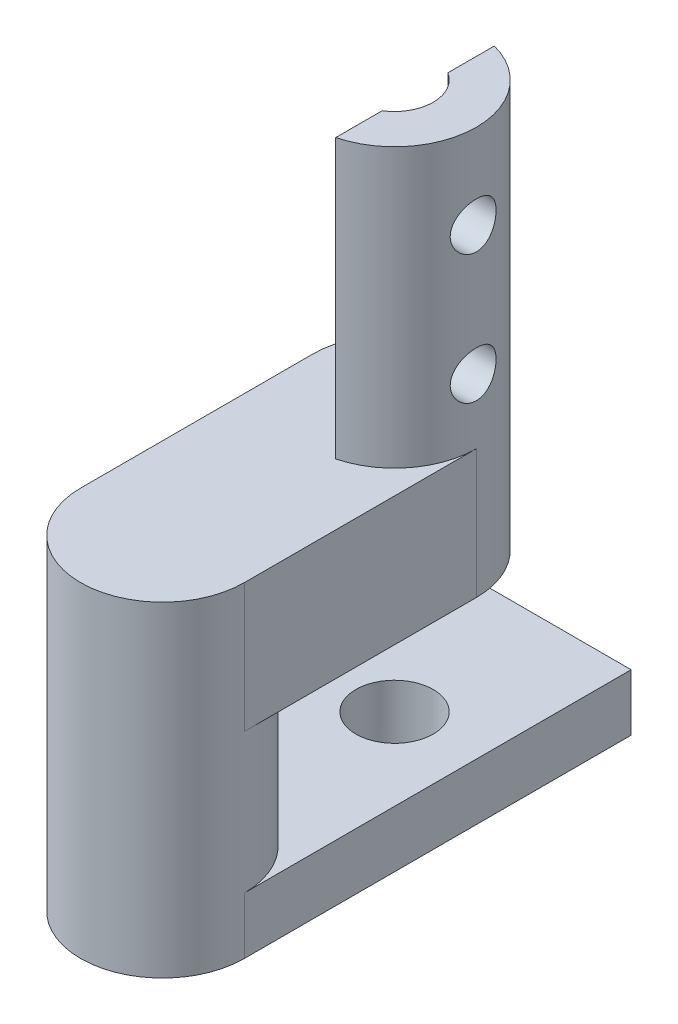
ISO-10303-21;
HEADER;
FILE_DESCRIPTION(('STEP AP214'),'2;1');
FILE_NAME('part.step','',(''),(''),'','','');
FILE_SCHEMA(('AUTOMOTIVE_DESIGN { 1 0 10303 214 1 1 1 1 }'));
ENDSEC;
DATA;
#1=APPLICATION_CONTEXT('core data for automotive mechanical design processes');
#2=APPLICATION_PROTOCOL_DEFINITION('international standard','automotive_design',2000,#1);
#3=PRODUCT_CONTEXT('',#1,'mechanical');
#4=PRODUCT('Part','Part','',(#3));
#5=PRODUCT_RELATED_PRODUCT_CATEGORY('part','',(#4));
#6=PRODUCT_DEFINITION_FORMATION('','',#4);
#7=PRODUCT_DEFINITION_CONTEXT('part definition',#1,'design');
#8=PRODUCT_DEFINITION('design','',#6,#7);
#9=PRODUCT_DEFINITION_SHAPE('','',#8);
#10=(LENGTH_UNIT() NAMED_UNIT(*) SI_UNIT(.MILLI.,.METRE.));
#11=(NAMED_UNIT(*) PLANE_ANGLE_UNIT() SI_UNIT($,.RADIAN.));
#12=(NAMED_UNIT(*) SI_UNIT($,.STERADIAN.) SOLID_ANGLE_UNIT());
#13=UNCERTAINTY_MEASURE_WITH_UNIT(LENGTH_MEASURE(1.E-05),#10,'distance_accuracy_value','');
#14=(GEOMETRIC_REPRESENTATION_CONTEXT(3) GLOBAL_UNCERTAINTY_ASSIGNED_CONTEXT((#13)) GLOBAL_UNIT_ASSIGNED_CONTEXT((#10,
#11,#12)) REPRESENTATION_CONTEXT('',''));
#15=CARTESIAN_POINT('',(0.,0.,0.));
#16=DIRECTION('',(0.,0.,1.));
#17=DIRECTION('',(1.,0.,0.));
#18=AXIS2_PLACEMENT_3D('',#15,#16,#17);
#19=CARTESIAN_POINT('',(0.,57.15,0.));
#20=DIRECTION('',(0.,-1.,0.));
#21=DIRECTION('',(0.,0.,-1.));
#22=AXIS2_PLACEMENT_3D('',#19,#20,#21);
#23=CYLINDRICAL_SURFACE('',#22,3.175);
#24=DIRECTION('',(0.,1.,0.));
#25=VECTOR('',#24,1.);
#26=CARTESIAN_POINT('',(3.175,33.73,0.));
#27=LINE('',#26,#25);
#28=CARTESIAN_POINT('',(3.175,33.73,0.));
#29=VERTEX_POINT('',#28);
#30=CARTESIAN_POINT('',(3.175,35.93,0.));
#31=VERTEX_POINT('',#30);
#32=EDGE_CURVE('E226',#29,#31,#27,.T.);
#33=ORIENTED_EDGE('',*,*,#32,.T.);
#34=CARTESIAN_POINT('',(0.,35.93,0.));
#35=DIRECTION('',(0.,-1.,0.));
#36=DIRECTION('',(0.,0.,-1.));
#37=AXIS2_PLACEMENT_3D('',#34,#35,#36);
#38=CIRCLE('',#37,3.175);
#39=CARTESIAN_POINT('',(-3.175,35.93,0.));
#40=VERTEX_POINT('',#39);
#41=EDGE_CURVE('E132',#40,#31,#38,.T.);
#42=ORIENTED_EDGE('',*,*,#41,.F.);
#43=DIRECTION('',(0.,1.,0.));
#44=VECTOR('',#43,1.);
#45=CARTESIAN_POINT('',(-3.175,33.73,0.));
#46=LINE('',#45,#44);
#47=CARTESIAN_POINT('',(-3.175,33.73,0.));
#48=VERTEX_POINT('',#47);
#49=EDGE_CURVE('E133',#48,#40,#46,.T.);
#50=ORIENTED_EDGE('',*,*,#49,.F.);
#51=CARTESIAN_POINT('',(0.,33.73,0.));
#52=DIRECTION('',(0.,-1.,0.));
#53=DIRECTION('',(0.,0.,-1.));
#54=AXIS2_PLACEMENT_3D('',#51,#52,#53);
#55=CIRCLE('',#54,3.175);
#56=EDGE_CURVE('E231',#29,#48,#55,.T.);
#57=ORIENTED_EDGE('',*,*,#56,.F.);
#58=EDGE_LOOP('',(#33,#42,#50,#57));
#59=FACE_BOUND('',#58,.T.);
#60=DIRECTION('',(0.,1.,0.));
#61=VECTOR('',#60,1.);
#62=CARTESIAN_POINT('',(3.175,41.355,0.));
#63=LINE('',#62,#61);
#64=CARTESIAN_POINT('',(3.175,41.355,0.));
#65=VERTEX_POINT('',#64);
#66=CARTESIAN_POINT('',(3.175,46.355,0.));
#67=VERTEX_POINT('',#66);
#68=EDGE_CURVE('E135',#65,#67,#63,.T.);
#69=ORIENTED_EDGE('',*,*,#68,.T.);
#70=CARTESIAN_POINT('',(0.,46.355,0.));
#71=DIRECTION('',(0.,-1.,0.));
#72=DIRECTION('',(0.,0.,-1.));
#73=AXIS2_PLACEMENT_3D('',#70,#71,#72);
#74=CIRCLE('',#73,3.175);
#75=CARTESIAN_POINT('',(-3.175,46.355,0.));
#76=VERTEX_POINT('',#75);
#77=EDGE_CURVE('E125',#67,#76,#74,.T.);
#78=ORIENTED_EDGE('',*,*,#77,.T.);
#79=DIRECTION('',(0.,1.,0.));
#80=VECTOR('',#79,1.);
#81=CARTESIAN_POINT('',(-3.175,41.355,0.));
#82=LINE('',#81,#80);
#83=CARTESIAN_POINT('',(-3.175,41.355,0.));
#84=VERTEX_POINT('',#83);
#85=EDGE_CURVE('E53',#84,#76,#82,.T.);
#86=ORIENTED_EDGE('',*,*,#85,.F.);
#87=CARTESIAN_POINT('',(0.,41.355,0.));
#88=DIRECTION('',(0.,-1.,0.));
#89=DIRECTION('',(0.,0.,1.));
#90=AXIS2_PLACEMENT_3D('',#87,#88,#89);
#91=CIRCLE('',#90,3.175);
#92=EDGE_CURVE('E57',#84,#65,#91,.T.);
#93=ORIENTED_EDGE('',*,*,#92,.T.);
#94=EDGE_LOOP('',(#69,#78,#86,#93));
#95=FACE_BOUND('',#94,.T.);
#96=ADVANCED_FACE('F37',(#59,#95),#23,.T.);
#97=CARTESIAN_POINT('',(0.,33.73,-9.));
#98=DIRECTION('',(0.,1.,0.));
#99=DIRECTION('',(0.,0.,1.));
#100=AXIS2_PLACEMENT_3D('',#97,#98,#99);
#101=CYLINDRICAL_SURFACE('',#100,1.5);
#102=CARTESIAN_POINT('',(0.,33.73,-9.));
#103=DIRECTION('',(0.,-1.,0.));
#104=DIRECTION('',(0.,0.,-1.));
#105=AXIS2_PLACEMENT_3D('',#102,#103,#104);
#106=CIRCLE('',#105,1.5);
#107=CARTESIAN_POINT('',(0.,33.73,-10.5));
#108=VERTEX_POINT('',#107);
#109=EDGE_CURVE('E258',#108,#108,#106,.T.);
#110=ORIENTED_EDGE('',*,*,#109,.T.);
#111=EDGE_LOOP('',(#110));
#112=FACE_BOUND('',#111,.T.);
#113=CARTESIAN_POINT('',(0.,35.93,-9.));
#114=DIRECTION('',(0.,1.,0.));
#115=DIRECTION('',(0.,0.,1.));
#116=AXIS2_PLACEMENT_3D('',#113,#114,#115);
#117=CIRCLE('',#116,1.5);
#118=CARTESIAN_POINT('',(0.,35.93,-7.5));
#119=VERTEX_POINT('',#118);
#120=EDGE_CURVE('E40',#119,#119,#117,.T.);
#121=ORIENTED_EDGE('',*,*,#120,.T.);
#122=EDGE_LOOP('',(#121));
#123=FACE_BOUND('',#122,.T.);
#124=ADVANCED_FACE('F203',(#112,#123),#101,.F.);
#125=CARTESIAN_POINT('',(0.,57.15,-9.));
#126=DIRECTION('',(0.,-1.,0.));
#127=DIRECTION('',(0.,0.,-1.));
#128=AXIS2_PLACEMENT_3D('',#125,#126,#127);
#129=CYLINDRICAL_SURFACE('',#128,3.175);
#130=CARTESIAN_POINT('',(3.048,53.855,-8.111));
#131=CARTESIAN_POINT('',(3.04800074144579,53.9038733654637,-8.11100097729502));
#132=CARTESIAN_POINT('',(3.0491883536904,53.9527567364062,-8.11504399409992));
#133=CARTESIAN_POINT('',(3.05379446473852,54.0491049848988,-8.13107438578842));
#134=CARTESIAN_POINT('',(3.05721393512249,54.096569235257,-8.14306522057987));
#135=CARTESIAN_POINT('',(3.06586679255467,54.1886712317961,-8.17456073973509));
#136=CARTESIAN_POINT('',(3.07109744934927,54.2333131134177,-8.19405411937212));
#137=CARTESIAN_POINT('',(3.08277975485952,54.3187015211283,-8.23996524363441));
#138=CARTESIAN_POINT('',(3.0892315334209,54.3594476322734,-8.26638372474263));
#139=CARTESIAN_POINT('',(3.10282851808416,54.4370111447716,-8.32617435077648));
#140=CARTESIAN_POINT('',(3.10998700385331,54.4737052421074,-8.35970346666669));
#141=CARTESIAN_POINT('',(3.12407666925912,54.5410299343499,-8.43242645778973));
#142=CARTESIAN_POINT('',(3.13100782316884,54.5716598449399,-8.47162097147539));
#143=CARTESIAN_POINT('',(3.14401109305889,54.6265090608122,-8.55542576249639));
#144=CARTESIAN_POINT('',(3.15006572408435,54.6506045660182,-8.60012001481016));
#145=CARTESIAN_POINT('',(3.16048064645675,54.6908915244847,-8.69312365720012));
#146=CARTESIAN_POINT('',(3.16484125401579,54.7070844530113,-8.74143237057917));
#147=CARTESIAN_POINT('',(3.17128288506878,54.7307040631926,-8.83900538660209));
#148=CARTESIAN_POINT('',(3.17341843142117,54.7383407786606,-8.88821518277643));
#149=CARTESIAN_POINT('',(3.17536048694193,54.7452932743307,-8.98726073752294));
#150=CARTESIAN_POINT('',(3.17516742430906,54.7446105843552,-9.03709637932715));
#151=CARTESIAN_POINT('',(3.17251342098985,54.735088882728,-9.13451260520955));
#152=CARTESIAN_POINT('',(3.17011563326432,54.7264769888744,-9.18211737468884));
#153=CARTESIAN_POINT('',(3.16339697389186,54.7017098300263,-9.27517690192062));
#154=CARTESIAN_POINT('',(3.15907598732543,54.6855541142527,-9.32063153101327));
#155=CARTESIAN_POINT('',(3.14890524255914,54.6459918167282,-9.40866474920156));
#156=CARTESIAN_POINT('',(3.14303970776309,54.6225099164607,-9.45120759228572));
#157=CARTESIAN_POINT('',(3.1304081222126,54.5690202636264,-9.53182461773852));
#158=CARTESIAN_POINT('',(3.12364188079185,54.5390111284853,-9.56989785073641));
#159=CARTESIAN_POINT('',(3.10966917671264,54.472123673229,-9.64185082699831));
#160=CARTESIAN_POINT('',(3.10245556376271,54.4350476993962,-9.67554567078815));
#161=CARTESIAN_POINT('',(3.08860471608588,54.3556980560687,-9.73628739726903));
#162=CARTESIAN_POINT('',(3.0819675243892,54.3134239991019,-9.763333783924));
#163=CARTESIAN_POINT('',(3.06999005425627,54.2244444097016,-9.81017122798041));
#164=CARTESIAN_POINT('',(3.06465973815351,54.1777083945776,-9.82990710543194));
#165=CARTESIAN_POINT('',(3.05602075215966,54.0813941993218,-9.86117844600627));
#166=CARTESIAN_POINT('',(3.05271152110212,54.0318168122998,-9.87271618553704));
#167=CARTESIAN_POINT('',(3.04861036820764,53.9329684098257,-9.88693469934459));
#168=CARTESIAN_POINT('',(3.04773950623862,53.8837405964397,-9.88989333194997));
#169=CARTESIAN_POINT('',(3.04839680667467,53.7854926125504,-9.8876392469048));
#170=CARTESIAN_POINT('',(3.04992468355344,53.7364724180303,-9.8824275017895));
#171=CARTESIAN_POINT('',(3.0551305705055,53.6411353392666,-9.86422658190341));
#172=CARTESIAN_POINT('',(3.05876110757367,53.5947828515508,-9.85140897691857));
#173=CARTESIAN_POINT('',(3.06771577424975,53.5048869252364,-9.8185553996083));
#174=CARTESIAN_POINT('',(3.07304014129867,53.4613438814956,-9.79851841521836));
#175=CARTESIAN_POINT('',(3.08494108557681,53.3771528913416,-9.75124525534362));
#176=CARTESIAN_POINT('',(3.09154455793357,53.336599053057,-9.72384841049196));
#177=CARTESIAN_POINT('',(3.10519857691837,53.2605624680078,-9.66282910075005));
#178=CARTESIAN_POINT('',(3.1122492163033,53.2250807783703,-9.62920534140098));
#179=CARTESIAN_POINT('',(3.12627846255595,53.1590184791837,-9.55539317554064));
#180=CARTESIAN_POINT('',(3.13324740753382,53.1286329109128,-9.5150279821198));
#181=CARTESIAN_POINT('',(3.14609634169483,53.0750663487539,-9.42961061530262));
#182=CARTESIAN_POINT('',(3.15197638840411,53.0518849742268,-9.38455868970136));
#183=CARTESIAN_POINT('',(3.16194727289417,53.013604157135,-9.29136154619421));
#184=CARTESIAN_POINT('',(3.16605159772319,52.9984435908583,-9.24324294885728));
#185=CARTESIAN_POINT('',(3.17206811720327,52.9764640428509,-9.14500759027884));
#186=CARTESIAN_POINT('',(3.17398085158866,52.969643007273,-9.09489132416108));
#187=CARTESIAN_POINT('',(3.17537031148509,52.9646756462352,-8.99589742534142));
#188=CARTESIAN_POINT('',(3.17492700643421,52.9662445579541,-8.94703501196227));
#189=CARTESIAN_POINT('',(3.17183800207679,52.9773438045136,-8.85029795369447));
#190=CARTESIAN_POINT('',(3.1691924010422,52.9868737841116,-8.80242326482878));
#191=CARTESIAN_POINT('',(3.16201473209881,53.0134573009097,-8.70940017929786));
#192=CARTESIAN_POINT('',(3.15749847230393,53.0304478626725,-8.66423248434458));
#193=CARTESIAN_POINT('',(3.14704937045712,53.071414238752,-8.57736359989234));
#194=CARTESIAN_POINT('',(3.1411163150138,53.0953911054345,-8.53566293385842));
#195=CARTESIAN_POINT('',(3.1282509933554,53.1504535292501,-8.45560768110128));
#196=CARTESIAN_POINT('',(3.12129485795685,53.1817240427912,-8.41738416358834));
#197=CARTESIAN_POINT('',(3.10725567651361,53.2501422555483,-8.34663111115433));
#198=CARTESIAN_POINT('',(3.10017259641915,53.287291553173,-8.31410312989945));
#199=CARTESIAN_POINT('',(3.08647631222338,53.3675262150993,-8.25485670656514));
#200=CARTESIAN_POINT('',(3.07987922601124,53.4107364855654,-8.22830332805203));
#201=CARTESIAN_POINT('',(3.06814009982461,53.5011873096253,-8.18287371937232));
#202=CARTESIAN_POINT('',(3.06299720300363,53.5484254684335,-8.16399296541486));
#203=CARTESIAN_POINT('',(3.05538486849527,53.638669406351,-8.13662309292289));
#204=CARTESIAN_POINT('',(3.05263934900825,53.6813225211211,-8.12703844344312));
#205=CARTESIAN_POINT('',(3.04894671224791,53.7676478578347,-8.11422691565757));
#206=CARTESIAN_POINT('',(3.04799933734046,53.8113199328759,-8.11099912655263));
#207=CARTESIAN_POINT('',(3.048,53.855,-8.111));
#208=B_SPLINE_CURVE_WITH_KNOTS('',3,(#130,#131,#132,#133,#134,#135,#136,#137,#138,#139,#140,
#141,#142,#143,#144,#145,#146,#147,#148,#149,#150,#151,#152,#153,#154,#155,#156,#157,#158,#159,
#160,#161,#162,#163,#164,#165,#166,#167,#168,#169,#170,#171,#172,#173,#174,#175,#176,#177,#178,
#179,#180,#181,#182,#183,#184,#185,#186,#187,#188,#189,#190,#191,#192,#193,#194,#195,#196,#197,
#198,#199,#200,#201,#202,#203,#204,#205,#206,#207),.UNSPECIFIED.,.T.,.F.,(4,2,2,2,2,2,2,2,2,2,2,
2,2,2,2,2,2,2,2,2,2,2,2,2,2,2,2,2,2,2,2,2,2,2,2,2,2,2,4),(0.,0.146459287401067,
0.292982374544872,0.439285541729908,0.585604274540456,0.735571650820735,0.885555940626639,
1.03820968127063,1.19083491334785,1.33962536162133,1.48838844982117,1.63301874819052,
1.77765769001139,1.923835554253,2.07004441154515,2.22118784811516,2.37234255795564,
2.52461599929671,2.6768471417545,2.82408956362907,2.97131446029551,3.1153382232534,
3.25938218435847,3.40687004300796,3.55438859610561,3.70666622842306,3.85893581366485,
4.01002765448382,4.1610822771287,4.30704320227681,4.45299761463259,4.59774301104066,
4.7425102221143,4.89144959773006,5.04042953893497,5.19312385990268,5.3457280209917,
5.47664325964223,5.60753973963556),.UNSPECIFIED.);
#209=CARTESIAN_POINT('',(3.048,53.855,-8.111));
#210=VERTEX_POINT('',#209);
#211=EDGE_CURVE('E155',#210,#210,#208,.T.);
#212=ORIENTED_EDGE('',*,*,#211,.T.);
#213=EDGE_LOOP('',(#212));
#214=FACE_BOUND('',#213,.T.);
#215=CARTESIAN_POINT('',(3.048,48.855,-8.111));
#216=CARTESIAN_POINT('',(3.04800074144579,48.9038733654637,-8.11100097729502));
#217=CARTESIAN_POINT('',(3.0491883536904,48.9527567364062,-8.11504399409992));
#218=CARTESIAN_POINT('',(3.05379446473852,49.0491049848988,-8.13107438578842));
#219=CARTESIAN_POINT('',(3.05721393512249,49.096569235257,-8.14306522057987));
#220=CARTESIAN_POINT('',(3.06586679255467,49.1886712317961,-8.17456073973509));
#221=CARTESIAN_POINT('',(3.07109744934927,49.2333131134177,-8.19405411937212));
#222=CARTESIAN_POINT('',(3.08277975485952,49.3187015211283,-8.23996524363441));
#223=CARTESIAN_POINT('',(3.0892315334209,49.3594476322734,-8.26638372474263));
#224=CARTESIAN_POINT('',(3.10282851808416,49.4370111447716,-8.32617435077648));
#225=CARTESIAN_POINT('',(3.10998700385331,49.4737052421074,-8.35970346666669));
#226=CARTESIAN_POINT('',(3.12407666925912,49.5410299343499,-8.43242645778973));
#227=CARTESIAN_POINT('',(3.13100782316884,49.5716598449399,-8.47162097147539));
#228=CARTESIAN_POINT('',(3.14401109305889,49.6265090608122,-8.55542576249639));
#229=CARTESIAN_POINT('',(3.15006572408435,49.6506045660182,-8.60012001481016));
#230=CARTESIAN_POINT('',(3.16048064645675,49.6908915244847,-8.69312365720012));
#231=CARTESIAN_POINT('',(3.16484125401579,49.7070844530113,-8.74143237057917));
#232=CARTESIAN_POINT('',(3.17128288506878,49.7307040631926,-8.83900538660209));
#233=CARTESIAN_POINT('',(3.17341843142117,49.7383407786606,-8.88821518277643));
#234=CARTESIAN_POINT('',(3.17536048694193,49.7452932743306,-8.98726073752294));
#235=CARTESIAN_POINT('',(3.17516742430906,49.7446105843552,-9.03709637932715));
#236=CARTESIAN_POINT('',(3.17251342098985,49.735088882728,-9.13451260520955));
#237=CARTESIAN_POINT('',(3.17011563326432,49.7264769888744,-9.18211737468884));
#238=CARTESIAN_POINT('',(3.16339697389186,49.7017098300263,-9.27517690192062));
#239=CARTESIAN_POINT('',(3.15907598732543,49.6855541142527,-9.32063153101327));
#240=CARTESIAN_POINT('',(3.14890524255914,49.6459918167282,-9.40866474920156));
#241=CARTESIAN_POINT('',(3.14303970776309,49.6225099164607,-9.45120759228572));
#242=CARTESIAN_POINT('',(3.1304081222126,49.5690202636264,-9.53182461773852));
#243=CARTESIAN_POINT('',(3.12364188079185,49.5390111284853,-9.56989785073641));
#244=CARTESIAN_POINT('',(3.10966917671264,49.472123673229,-9.64185082699831));
#245=CARTESIAN_POINT('',(3.10245556376271,49.4350476993962,-9.67554567078815));
#246=CARTESIAN_POINT('',(3.08860471608588,49.3556980560687,-9.73628739726903));
#247=CARTESIAN_POINT('',(3.0819675243892,49.3134239991019,-9.763333783924));
#248=CARTESIAN_POINT('',(3.06999005425627,49.2244444097016,-9.81017122798041));
#249=CARTESIAN_POINT('',(3.06465973815351,49.1777083945775,-9.82990710543194));
#250=CARTESIAN_POINT('',(3.05602075215966,49.0813941993218,-9.86117844600627));
#251=CARTESIAN_POINT('',(3.05271152110212,49.0318168122998,-9.87271618553704));
#252=CARTESIAN_POINT('',(3.04861036820764,48.9329684098257,-9.88693469934459));
#253=CARTESIAN_POINT('',(3.04773950623862,48.8837405964397,-9.88989333194997));
#254=CARTESIAN_POINT('',(3.04839680667467,48.7854926125504,-9.8876392469048));
#255=CARTESIAN_POINT('',(3.04992468355344,48.7364724180303,-9.8824275017895));
#256=CARTESIAN_POINT('',(3.0551305705055,48.6411353392666,-9.86422658190341));
#257=CARTESIAN_POINT('',(3.05876110757367,48.5947828515507,-9.85140897691857));
#258=CARTESIAN_POINT('',(3.06771577424975,48.5048869252364,-9.8185553996083));
#259=CARTESIAN_POINT('',(3.07304014129867,48.4613438814956,-9.79851841521836));
#260=CARTESIAN_POINT('',(3.08494108557681,48.3771528913416,-9.75124525534362));
#261=CARTESIAN_POINT('',(3.09154455793357,48.336599053057,-9.72384841049196));
#262=CARTESIAN_POINT('',(3.10519857691837,48.2605624680078,-9.66282910075005));
#263=CARTESIAN_POINT('',(3.1122492163033,48.2250807783703,-9.62920534140098));
#264=CARTESIAN_POINT('',(3.12627846255595,48.1590184791837,-9.55539317554064));
#265=CARTESIAN_POINT('',(3.13324740753382,48.1286329109128,-9.5150279821198));
#266=CARTESIAN_POINT('',(3.14609634169483,48.0750663487539,-9.42961061530262));
#267=CARTESIAN_POINT('',(3.15197638840411,48.0518849742268,-9.38455868970136));
#268=CARTESIAN_POINT('',(3.16194727289417,48.013604157135,-9.29136154619421));
#269=CARTESIAN_POINT('',(3.16605159772319,47.9984435908583,-9.24324294885728));
#270=CARTESIAN_POINT('',(3.17206811720327,47.9764640428509,-9.14500759027884));
#271=CARTESIAN_POINT('',(3.17398085158866,47.969643007273,-9.09489132416108));
#272=CARTESIAN_POINT('',(3.17537031148509,47.9646756462352,-8.99589742534142));
#273=CARTESIAN_POINT('',(3.17492700643421,47.9662445579541,-8.94703501196227));
#274=CARTESIAN_POINT('',(3.17183800207679,47.9773438045136,-8.85029795369447));
#275=CARTESIAN_POINT('',(3.1691924010422,47.9868737841115,-8.80242326482878));
#276=CARTESIAN_POINT('',(3.16201473209881,48.0134573009097,-8.70940017929786));
#277=CARTESIAN_POINT('',(3.15749847230393,48.0304478626725,-8.66423248434458));
#278=CARTESIAN_POINT('',(3.14704937045712,48.071414238752,-8.57736359989234));
#279=CARTESIAN_POINT('',(3.1411163150138,48.0953911054345,-8.53566293385842));
#280=CARTESIAN_POINT('',(3.1282509933554,48.1504535292501,-8.45560768110128));
#281=CARTESIAN_POINT('',(3.12129485795685,48.1817240427912,-8.41738416358834));
#282=CARTESIAN_POINT('',(3.10725567651361,48.2501422555483,-8.34663111115433));
#283=CARTESIAN_POINT('',(3.10017259641915,48.287291553173,-8.31410312989945));
#284=CARTESIAN_POINT('',(3.08647631222338,48.3675262150993,-8.25485670656514));
#285=CARTESIAN_POINT('',(3.07987922601124,48.4107364855654,-8.22830332805203));
#286=CARTESIAN_POINT('',(3.06814009982461,48.5011873096253,-8.18287371937232));
#287=CARTESIAN_POINT('',(3.06299720300363,48.5484254684335,-8.16399296541486));
#288=CARTESIAN_POINT('',(3.05538486849527,48.638669406351,-8.13662309292289));
#289=CARTESIAN_POINT('',(3.05263934900825,48.6813225211211,-8.12703844344312));
#290=CARTESIAN_POINT('',(3.04894671224791,48.7676478578347,-8.11422691565757));
#291=CARTESIAN_POINT('',(3.04799933734046,48.8113199328759,-8.11099912655263));
#292=CARTESIAN_POINT('',(3.048,48.855,-8.111));
#293=B_SPLINE_CURVE_WITH_KNOTS('',3,(#215,#216,#217,#218,#219,#220,#221,#222,#223,#224,#225,
#226,#227,#228,#229,#230,#231,#232,#233,#234,#235,#236,#237,#238,#239,#240,#241,#242,#243,#244,
#245,#246,#247,#248,#249,#250,#251,#252,#253,#254,#255,#256,#257,#258,#259,#260,#261,#262,#263,
#264,#265,#266,#267,#268,#269,#270,#271,#272,#273,#274,#275,#276,#277,#278,#279,#280,#281,#282,
#283,#284,#285,#286,#287,#288,#289,#290,#291,#292),.UNSPECIFIED.,.T.,.F.,(4,2,2,2,2,2,2,2,2,2,2,
2,2,2,2,2,2,2,2,2,2,2,2,2,2,2,2,2,2,2,2,2,2,2,2,2,2,2,4),(0.,0.146459287401067,
0.292982374544872,0.439285541729908,0.585604274540456,0.735571650820735,0.885555940626639,
1.03820968127063,1.19083491334785,1.33962536162133,1.48838844982117,1.63301874819052,
1.77765769001139,1.923835554253,2.07004441154515,2.22118784811516,2.37234255795564,
2.52461599929671,2.6768471417545,2.82408956362906,2.97131446029551,3.1153382232534,
3.25938218435847,3.40687004300796,3.55438859610561,3.70666622842306,3.85893581366485,
4.01002765448382,4.1610822771287,4.30704320227681,4.45299761463259,4.59774301104065,
4.7425102221143,4.89144959773006,5.04042953893497,5.19312385990268,5.3457280209917,
5.47664325964223,5.60753973963556),.UNSPECIFIED.);
#294=CARTESIAN_POINT('',(3.048,48.855,-8.111));
#295=VERTEX_POINT('',#294);
#296=EDGE_CURVE('E168',#295,#295,#293,.T.);
#297=ORIENTED_EDGE('',*,*,#296,.T.);
#298=EDGE_LOOP('',(#297));
#299=FACE_BOUND('',#298,.T.);
#300=DIRECTION('',(0.,1.,0.));
#301=VECTOR('',#300,1.);
#302=CARTESIAN_POINT('',(3.175,41.355,-9.));
#303=LINE('',#302,#301);
#304=CARTESIAN_POINT('',(3.175,41.355,-9.));
#305=VERTEX_POINT('',#304);
#306=CARTESIAN_POINT('',(3.175,46.355,-9.));
#307=VERTEX_POINT('',#306);
#308=EDGE_CURVE('E139',#305,#307,#303,.T.);
#309=ORIENTED_EDGE('',*,*,#308,.F.);
#310=CARTESIAN_POINT('',(0.,41.355,-9.));
#311=DIRECTION('',(0.,1.,0.));
#312=DIRECTION('',(0.,0.,1.));
#313=AXIS2_PLACEMENT_3D('',#310,#311,#312);
#314=CIRCLE('',#313,3.175);
#315=CARTESIAN_POINT('',(-3.175,41.355,-9.));
#316=VERTEX_POINT('',#315);
#317=EDGE_CURVE('E467',#305,#316,#314,.T.);
#318=ORIENTED_EDGE('',*,*,#317,.T.);
#319=DIRECTION('',(0.,1.,0.));
#320=VECTOR('',#319,1.);
#321=CARTESIAN_POINT('',(-3.175,41.355,-9.));
#322=LINE('',#321,#320);
#323=CARTESIAN_POINT('',(-3.175,46.355,-9.));
#324=VERTEX_POINT('',#323);
#325=EDGE_CURVE('E156',#316,#324,#322,.T.);
#326=ORIENTED_EDGE('',*,*,#325,.T.);
#327=CARTESIAN_POINT('',(0.,46.355,-9.));
#328=DIRECTION('',(0.,-1.,0.));
#329=DIRECTION('',(0.,0.,-1.));
#330=AXIS2_PLACEMENT_3D('',#327,#328,#329);
#331=CIRCLE('',#330,3.175);
#332=CARTESIAN_POINT('',(0.794,46.355,-12.0741159704865));
#333=VERTEX_POINT('',#332);
#334=EDGE_CURVE('E11',#324,#333,#331,.T.);
#335=ORIENTED_EDGE('',*,*,#334,.T.);
#336=DIRECTION('',(0.,-1.,0.));
#337=VECTOR('',#336,1.);
#338=CARTESIAN_POINT('',(0.794,57.15,-12.0741159704865));
#339=LINE('',#338,#337);
#340=CARTESIAN_POINT('',(0.794,57.15,-12.0741159704865));
#341=VERTEX_POINT('',#340);
#342=EDGE_CURVE('E446',#333,#341,#339,.F.);
#343=ORIENTED_EDGE('',*,*,#342,.T.);
#344=CARTESIAN_POINT('',(0.,57.15,-9.));
#345=DIRECTION('',(0.,1.,0.));
#346=DIRECTION('',(0.,0.,1.));
#347=AXIS2_PLACEMENT_3D('',#344,#345,#346);
#348=CIRCLE('',#347,3.175);
#349=CARTESIAN_POINT('',(0.794,57.15,-5.92588402951352));
#350=VERTEX_POINT('',#349);
#351=EDGE_CURVE('E251',#350,#341,#348,.T.);
#352=ORIENTED_EDGE('',*,*,#351,.F.);
#353=DIRECTION('',(0.,-1.,0.));
#354=VECTOR('',#353,1.);
#355=CARTESIAN_POINT('',(0.794,57.15,-5.92588402951352));
#356=LINE('',#355,#354);
#357=CARTESIAN_POINT('',(0.794,46.355,-5.92588402951352));
#358=VERTEX_POINT('',#357);
#359=EDGE_CURVE('E445',#350,#358,#356,.T.);
#360=ORIENTED_EDGE('',*,*,#359,.T.);
#361=CARTESIAN_POINT('',(0.,46.355,-9.));
#362=DIRECTION('',(0.,-1.,0.));
#363=DIRECTION('',(0.,0.,1.));
#364=AXIS2_PLACEMENT_3D('',#361,#362,#363);
#365=CIRCLE('',#364,3.175);
#366=EDGE_CURVE('E145',#307,#358,#365,.T.);
#367=ORIENTED_EDGE('',*,*,#366,.F.);
#368=EDGE_LOOP('',(#309,#318,#326,#335,#343,#352,#360,#367));
#369=FACE_BOUND('',#368,.T.);
#370=ADVANCED_FACE('F200',(#214,#299,#369),#129,.T.);
#371=CARTESIAN_POINT('',(0.,46.355,0.));
#372=DIRECTION('',(0.,-1.,0.));
#373=DIRECTION('',(0.,0.,-1.));
#374=AXIS2_PLACEMENT_3D('',#371,#372,#373);
#375=PLANE('',#374);
#376=ORIENTED_EDGE('',*,*,#77,.F.);
#377=DIRECTION('',(0.,0.,-1.));
#378=VECTOR('',#377,1.);
#379=CARTESIAN_POINT('',(3.175,46.355,-9.));
#380=LINE('',#379,#378);
#381=EDGE_CURVE('E129',#67,#307,#380,.T.);
#382=ORIENTED_EDGE('',*,*,#381,.T.);
#383=ORIENTED_EDGE('',*,*,#366,.T.);
#384=DIRECTION('',(0.,0.,-1.));
#385=VECTOR('',#384,1.);
#386=CARTESIAN_POINT('',(0.794,46.355,-12.175));
#387=LINE('',#386,#385);
#388=CARTESIAN_POINT('',(0.794,46.355,-7.72737908236584));
#389=VERTEX_POINT('',#388);
#390=EDGE_CURVE('E443',#358,#389,#387,.T.);
#391=ORIENTED_EDGE('',*,*,#390,.T.);
#392=CARTESIAN_POINT('',(0.,46.355,-9.));
#393=DIRECTION('',(0.,-1.,0.));
#394=DIRECTION('',(0.,0.,-1.));
#395=AXIS2_PLACEMENT_3D('',#392,#393,#394);
#396=CIRCLE('',#395,1.5);
#397=CARTESIAN_POINT('',(0.794,46.355,-10.2726209176342));
#398=VERTEX_POINT('',#397);
#399=EDGE_CURVE('E252',#389,#398,#396,.T.);
#400=ORIENTED_EDGE('',*,*,#399,.T.);
#401=EDGE_CURVE('E447',#398,#333,#387,.T.);
#402=ORIENTED_EDGE('',*,*,#401,.T.);
#403=ORIENTED_EDGE('',*,*,#334,.F.);
#404=DIRECTION('',(0.,0.,1.));
#405=VECTOR('',#404,1.);
#406=CARTESIAN_POINT('',(-3.175,46.355,0.));
#407=LINE('',#406,#405);
#408=EDGE_CURVE('E131',#324,#76,#407,.T.);
#409=ORIENTED_EDGE('',*,*,#408,.T.);
#410=EDGE_LOOP('',(#376,#382,#383,#391,#400,#402,#403,#409));
#411=FACE_BOUND('',#410,.T.);
#412=ADVANCED_FACE('F126',(#411),#375,.F.);
#413=CARTESIAN_POINT('',(0.,33.73,0.));
#414=DIRECTION('',(0.,-1.,0.));
#415=DIRECTION('',(0.,0.,-1.));
#416=AXIS2_PLACEMENT_3D('',#413,#414,#415);
#417=PLANE('',#416);
#418=ORIENTED_EDGE('',*,*,#56,.T.);
#419=DIRECTION('',(0.,0.,-1.));
#420=VECTOR('',#419,1.);
#421=CARTESIAN_POINT('',(-3.175,33.73,-15.));
#422=LINE('',#421,#420);
#423=CARTESIAN_POINT('',(-3.175,33.73,-15.));
#424=VERTEX_POINT('',#423);
#425=EDGE_CURVE('E273',#48,#424,#422,.T.);
#426=ORIENTED_EDGE('',*,*,#425,.T.);
#427=DIRECTION('',(1.,0.,0.));
#428=VECTOR('',#427,1.);
#429=CARTESIAN_POINT('',(3.175,33.73,-15.));
#430=LINE('',#429,#428);
#431=CARTESIAN_POINT('',(3.175,33.73,-15.));
#432=VERTEX_POINT('',#431);
#433=EDGE_CURVE('E275',#424,#432,#430,.T.);
#434=ORIENTED_EDGE('',*,*,#433,.T.);
#435=DIRECTION('',(0.,0.,1.));
#436=VECTOR('',#435,1.);
#437=CARTESIAN_POINT('',(3.175,33.73,0.));
#438=LINE('',#437,#436);
#439=EDGE_CURVE('E236',#432,#29,#438,.T.);
#440=ORIENTED_EDGE('',*,*,#439,.T.);
#441=EDGE_LOOP('',(#418,#426,#434,#440));
#442=FACE_BOUND('',#441,.T.);
#443=ORIENTED_EDGE('',*,*,#109,.F.);
#444=EDGE_LOOP('',(#443));
#445=FACE_BOUND('',#444,.T.);
#446=ADVANCED_FACE('F291',(#442,#445),#417,.T.);
#447=CARTESIAN_POINT('',(0.,35.93,0.));
#448=DIRECTION('',(0.,-1.,0.));
#449=DIRECTION('',(0.,0.,-1.));
#450=AXIS2_PLACEMENT_3D('',#447,#448,#449);
#451=PLANE('',#450);
#452=DIRECTION('',(1.,0.,0.));
#453=VECTOR('',#452,1.);
#454=CARTESIAN_POINT('',(3.175,35.93,-15.));
#455=LINE('',#454,#453);
#456=CARTESIAN_POINT('',(-3.175,35.93,-15.));
#457=VERTEX_POINT('',#456);
#458=CARTESIAN_POINT('',(3.175,35.93,-15.));
#459=VERTEX_POINT('',#458);
#460=EDGE_CURVE('E279',#457,#459,#455,.T.);
#461=ORIENTED_EDGE('',*,*,#460,.F.);
#462=DIRECTION('',(0.,0.,-1.));
#463=VECTOR('',#462,1.);
#464=CARTESIAN_POINT('',(-3.175,35.93,-15.));
#465=LINE('',#464,#463);
#466=EDGE_CURVE('E244',#40,#457,#465,.T.);
#467=ORIENTED_EDGE('',*,*,#466,.F.);
#468=ORIENTED_EDGE('',*,*,#41,.T.);
#469=DIRECTION('',(0.,0.,1.));
#470=VECTOR('',#469,1.);
#471=CARTESIAN_POINT('',(3.175,35.93,0.));
#472=LINE('',#471,#470);
#473=EDGE_CURVE('E243',#459,#31,#472,.T.);
#474=ORIENTED_EDGE('',*,*,#473,.F.);
#475=EDGE_LOOP('',(#461,#467,#468,#474));
#476=FACE_BOUND('',#475,.T.);
#477=ORIENTED_EDGE('',*,*,#120,.F.);
#478=EDGE_LOOP('',(#477));
#479=FACE_BOUND('',#478,.T.);
#480=ADVANCED_FACE('F241',(#476,#479),#451,.F.);
#481=CARTESIAN_POINT('',(-3.175,33.73,-15.));
#482=DIRECTION('',(1.,0.,0.));
#483=DIRECTION('',(0.,0.,-1.));
#484=AXIS2_PLACEMENT_3D('',#481,#482,#483);
#485=PLANE('',#484);
#486=ORIENTED_EDGE('',*,*,#466,.T.);
#487=DIRECTION('',(0.,1.,0.));
#488=VECTOR('',#487,1.);
#489=CARTESIAN_POINT('',(-3.175,33.73,-15.));
#490=LINE('',#489,#488);
#491=EDGE_CURVE('E284',#424,#457,#490,.T.);
#492=ORIENTED_EDGE('',*,*,#491,.F.);
#493=ORIENTED_EDGE('',*,*,#425,.F.);
#494=ORIENTED_EDGE('',*,*,#49,.T.);
#495=EDGE_LOOP('',(#486,#492,#493,#494));
#496=FACE_BOUND('',#495,.T.);
#497=ADVANCED_FACE('F287',(#496),#485,.F.);
#498=CARTESIAN_POINT('',(3.175,33.73,-15.));
#499=DIRECTION('',(0.,0.,1.));
#500=DIRECTION('',(1.,0.,0.));
#501=AXIS2_PLACEMENT_3D('',#498,#499,#500);
#502=PLANE('',#501);
#503=ORIENTED_EDGE('',*,*,#460,.T.);
#504=DIRECTION('',(0.,1.,0.));
#505=VECTOR('',#504,1.);
#506=CARTESIAN_POINT('',(3.175,33.73,-15.));
#507=LINE('',#506,#505);
#508=EDGE_CURVE('E235',#432,#459,#507,.T.);
#509=ORIENTED_EDGE('',*,*,#508,.F.);
#510=ORIENTED_EDGE('',*,*,#433,.F.);
#511=ORIENTED_EDGE('',*,*,#491,.T.);
#512=EDGE_LOOP('',(#503,#509,#510,#511));
#513=FACE_BOUND('',#512,.T.);
#514=ADVANCED_FACE('F295',(#513),#502,.F.);
#515=CARTESIAN_POINT('',(3.175,33.73,0.));
#516=DIRECTION('',(-1.,0.,0.));
#517=DIRECTION('',(0.,0.,1.));
#518=AXIS2_PLACEMENT_3D('',#515,#516,#517);
#519=PLANE('',#518);
#520=ORIENTED_EDGE('',*,*,#473,.T.);
#521=ORIENTED_EDGE('',*,*,#32,.F.);
#522=ORIENTED_EDGE('',*,*,#439,.F.);
#523=ORIENTED_EDGE('',*,*,#508,.T.);
#524=EDGE_LOOP('',(#520,#521,#522,#523));
#525=FACE_BOUND('',#524,.T.);
#526=ADVANCED_FACE('F214',(#525),#519,.F.);
#527=CARTESIAN_POINT('',(0.,41.355,-9.));
#528=DIRECTION('',(0.,1.,0.));
#529=DIRECTION('',(0.,0.,1.));
#530=AXIS2_PLACEMENT_3D('',#527,#528,#529);
#531=CIRCLE('',#530,1.5);
#532=CARTESIAN_POINT('',(0.,41.355,-7.5));
#533=VERTEX_POINT('',#532);
#534=EDGE_CURVE('E149',#533,#533,#531,.T.);
#535=ORIENTED_EDGE('',*,*,#534,.F.);
#536=EDGE_LOOP('',(#535));
#537=FACE_BOUND('',#536,.T.);
#538=CARTESIAN_POINT('',(1.20817175931239,48.855,-8.111));
#539=CARTESIAN_POINT('',(1.20816989914022,48.8998649890539,-8.1109986477967));
#540=CARTESIAN_POINT('',(1.21070819666087,48.944723162369,-8.11441703406376));
#541=CARTESIAN_POINT('',(1.22041501036715,49.0329409188663,-8.1278457995103));
#542=CARTESIAN_POINT('',(1.22758828636176,49.0762989131892,-8.13786295538572));
#543=CARTESIAN_POINT('',(1.2454183278222,49.1600523978972,-8.1638324940722));
#544=CARTESIAN_POINT('',(1.25605058968849,49.2004663483781,-8.17974323328823));
#545=CARTESIAN_POINT('',(1.27955556042605,49.278027337316,-8.21691604913222));
#546=CARTESIAN_POINT('',(1.29242896612006,49.3151733542746,-8.23817979105067));
#547=CARTESIAN_POINT('',(1.32081794631381,49.3899944060434,-8.2884055530823));
#548=CARTESIAN_POINT('',(1.33646565207844,49.427206635046,-8.31798246806849));
#549=CARTESIAN_POINT('',(1.36757959323908,49.4965250836591,-8.38273337637385));
#550=CARTESIAN_POINT('',(1.38304568921608,49.5286275912521,-8.41791140191114));
#551=CARTESIAN_POINT('',(1.41397244285939,49.5901312521638,-8.49732735753419));
#552=CARTESIAN_POINT('',(1.42926364942829,49.6188995780606,-8.54212788909388));
#553=CARTESIAN_POINT('',(1.45624981350514,49.6682725571069,-8.63701154483117));
#554=CARTESIAN_POINT('',(1.46794798185883,49.6888845038176,-8.68708989851291));
#555=CARTESIAN_POINT('',(1.48544852984269,49.7193017623245,-8.78615270387172));
#556=CARTESIAN_POINT('',(1.49170040787227,49.7299382567421,-8.83480049792281));
#557=CARTESIAN_POINT('',(1.49934274986454,49.7429069343765,-8.9335514007747));
#558=CARTESIAN_POINT('',(1.50073763648535,49.7452466724535,-8.98365314369692));
#559=CARTESIAN_POINT('',(1.49864785054419,49.7417164426496,-9.07735013956939));
#560=CARTESIAN_POINT('',(1.49573351493984,49.7368061531894,-9.12099872622052));
#561=CARTESIAN_POINT('',(1.48631281423469,49.7207304871412,-9.20672019408524));
#562=CARTESIAN_POINT('',(1.47980618354944,49.709564648069,-9.24879295855001));
#563=CARTESIAN_POINT('',(1.46371161752534,49.6813818248516,-9.33060592132799));
#564=CARTESIAN_POINT('',(1.45410346296009,49.6643263933537,-9.37032873178037));
#565=CARTESIAN_POINT('',(1.43258162009466,49.624988258131,-9.44640208839968));
#566=CARTESIAN_POINT('',(1.42066731184839,49.6027041484772,-9.48275172388519));
#567=CARTESIAN_POINT('',(1.39389565447518,49.5505751606653,-9.55563829438049));
#568=CARTESIAN_POINT('',(1.37885693878394,49.5201486982156,-9.59169229900203));
#569=CARTESIAN_POINT('',(1.34823836394709,49.4541031697759,-9.65848817684028));
#570=CARTESIAN_POINT('',(1.33265781185127,49.4184772531642,-9.68922292296555));
#571=CARTESIAN_POINT('',(1.30068436516853,49.3383229884443,-9.74796915497105));
#572=CARTESIAN_POINT('',(1.28439498725915,49.2932447895352,-9.77529348722559));
#573=CARTESIAN_POINT('',(1.255138280837,49.1981087026729,-9.82181977141809));
#574=CARTESIAN_POINT('',(1.24216488885927,49.1480601394974,-9.8410365908879));
#575=CARTESIAN_POINT('',(1.22431604803928,49.0568792329296,-9.86673682206252));
#576=CARTESIAN_POINT('',(1.21823899331223,49.0165344624996,-9.87517947469831));
#577=CARTESIAN_POINT('',(1.21011458032352,48.9346814025252,-9.88638202458704));
#578=CARTESIAN_POINT('',(1.2080627589888,48.8931744534461,-9.88914821590809));
#579=CARTESIAN_POINT('',(1.20828998392796,48.8101485685853,-9.88883924790259));
#580=CARTESIAN_POINT('',(1.21057404949686,48.7686296746095,-9.88575731869583));
#581=CARTESIAN_POINT('',(1.21914004964482,48.6868224692964,-9.87392713965083));
#582=CARTESIAN_POINT('',(1.22542508582054,48.6465351380959,-9.86517449371675));
#583=CARTESIAN_POINT('',(1.24118374738037,48.568042648804,-9.84240884322805));
#584=CARTESIAN_POINT('',(1.25066576975179,48.5298432851053,-9.82838197446154));
#585=CARTESIAN_POINT('',(1.27179666650428,48.4562086902494,-9.79555868308962));
#586=CARTESIAN_POINT('',(1.28344637469786,48.420774530213,-9.77676042412572));
#587=CARTESIAN_POINT('',(1.31008487465358,48.3470364853584,-9.73109023053296));
#588=CARTESIAN_POINT('',(1.32529980274443,48.3093336376442,-9.70337835329441));
#589=CARTESIAN_POINT('',(1.35589570467179,48.2387311891219,-9.64242648290196));
#590=CARTESIAN_POINT('',(1.37127681991351,48.2058360929691,-9.60918136691963));
#591=CARTESIAN_POINT('',(1.40268617963121,48.1417524048948,-9.53325067479728));
#592=CARTESIAN_POINT('',(1.41856495803781,48.111259997535,-9.48990840495935));
#593=CARTESIAN_POINT('',(1.44712393726545,48.058137248812,-9.39768787925452));
#594=CARTESIAN_POINT('',(1.45980639078412,48.0355013660799,-9.34881355765548));
#595=CARTESIAN_POINT('',(1.47967979298242,48.0006215895318,-9.25071668066459));
#596=CARTESIAN_POINT('',(1.48721304275932,47.9877221587494,-9.20179898174174));
#597=CARTESIAN_POINT('',(1.49736475767338,47.9704249245621,-9.10200255386234));
#598=CARTESIAN_POINT('',(1.4999884524429,47.9660180747547,-9.05112597054379));
#599=CARTESIAN_POINT('',(1.50001001385949,47.965984331237,-8.95596661395846));
#600=CARTESIAN_POINT('',(1.49803834586406,47.9692981669291,-8.91167986842569));
#601=CARTESIAN_POINT('',(1.49033160703471,47.9823961215063,-8.8244166933612));
#602=CARTESIAN_POINT('',(1.4845964471506,47.9921803934922,-8.78144029485955));
#603=CARTESIAN_POINT('',(1.46996320322184,48.0176117496414,-8.69838912680961));
#604=CARTESIAN_POINT('',(1.46110095078187,48.0331925205468,-8.65828743452622));
#605=CARTESIAN_POINT('',(1.44091465606759,48.0696427143411,-8.58124861588151));
#606=CARTESIAN_POINT('',(1.4295900355838,48.0905133795859,-8.54431223563876));
#607=CARTESIAN_POINT('',(1.40396559807182,48.1395114818273,-8.47030517142957));
#608=CARTESIAN_POINT('',(1.38947588761045,48.1681827199802,-8.43366097151487));
#609=CARTESIAN_POINT('',(1.35966571446071,48.2306866427002,-8.3654141937089));
#610=CARTESIAN_POINT('',(1.34434431326096,48.2645252397675,-8.33381747698807));
#611=CARTESIAN_POINT('',(1.3123561362708,48.3412294419652,-8.27264103024593));
#612=CARTESIAN_POINT('',(1.29575175085193,48.3846921840993,-8.24377147712061));
#613=CARTESIAN_POINT('',(1.26525833614768,48.476746279463,-8.19378577875904));
#614=CARTESIAN_POINT('',(1.25136699674202,48.5253332147398,-8.17266302365994));
#615=CARTESIAN_POINT('',(1.23000636655521,48.6202757867878,-8.14127896692194));
#616=CARTESIAN_POINT('',(1.22195259502629,48.6661552609929,-8.12999234032138));
#617=CARTESIAN_POINT('',(1.21104088175217,48.7596945911956,-8.11486016673224));
#618=CARTESIAN_POINT('',(1.2081737349082,48.8073511395047,-8.11100143610748));
#619=CARTESIAN_POINT('',(1.20817175931239,48.855,-8.111));
#620=B_SPLINE_CURVE_WITH_KNOTS('',3,(#538,#539,#540,#541,#542,#543,#544,#545,#546,#547,#548,
#549,#550,#551,#552,#553,#554,#555,#556,#557,#558,#559,#560,#561,#562,#563,#564,#565,#566,#567,
#568,#569,#570,#571,#572,#573,#574,#575,#576,#577,#578,#579,#580,#581,#582,#583,#584,#585,#586,
#587,#588,#589,#590,#591,#592,#593,#594,#595,#596,#597,#598,#599,#600,#601,#602,#603,#604,#605,
#606,#607,#608,#609,#610,#611,#612,#613,#614,#615,#616,#617,#618,#619),.UNSPECIFIED.,.T.,.F.,(4,
2,2,2,2,2,2,2,2,2,2,2,2,2,2,2,2,2,2,2,2,2,2,2,2,2,2,2,2,2,2,2,2,2,2,2,2,2,2,2,4),(0.,
0.134395295768086,0.268928826225559,0.402529343860962,0.536171475375254,0.685712745976282,
0.835362161602456,1.00064944011254,1.16578858034409,1.3154644684322,1.46500402960791,
1.59643834557283,1.7278823800006,1.86020123225104,1.99255570431576,2.14051063458588,
2.2886622951411,2.45335463736895,2.61774364057464,2.74219788972557,2.86651406910775,
2.99097424673689,3.11553102496102,3.2404175376806,3.36535218837805,3.51238556389734,
3.65955583210914,3.82465636997557,3.98964022125393,4.14216845429693,4.29453412237144,
4.42724480568509,4.55995862925777,4.69119866315447,4.82246954798001,4.96808674254871,
5.11387181854834,5.2773498388432,5.44068804716168,5.5836765902406,5.72641111072789),.UNSPECIFIED.);
#621=CARTESIAN_POINT('',(1.20817175931239,48.855,-8.111));
#622=VERTEX_POINT('',#621);
#623=EDGE_CURVE('E169',#622,#622,#620,.T.);
#624=ORIENTED_EDGE('',*,*,#623,.F.);
#625=EDGE_LOOP('',(#624));
#626=FACE_BOUND('',#625,.T.);
#627=CARTESIAN_POINT('',(1.20817175931239,53.855,-8.111));
#628=CARTESIAN_POINT('',(1.20816989914022,53.8998649890539,-8.1109986477967));
#629=CARTESIAN_POINT('',(1.21070819666087,53.944723162369,-8.11441703406376));
#630=CARTESIAN_POINT('',(1.22041501036715,54.0329409188663,-8.1278457995103));
#631=CARTESIAN_POINT('',(1.22758828636176,54.0762989131892,-8.13786295538572));
#632=CARTESIAN_POINT('',(1.2454183278222,54.1600523978972,-8.1638324940722));
#633=CARTESIAN_POINT('',(1.25605058968849,54.2004663483781,-8.17974323328823));
#634=CARTESIAN_POINT('',(1.27955556042605,54.278027337316,-8.21691604913222));
#635=CARTESIAN_POINT('',(1.29242896612006,54.3151733542746,-8.23817979105067));
#636=CARTESIAN_POINT('',(1.32081794631381,54.3899944060434,-8.2884055530823));
#637=CARTESIAN_POINT('',(1.33646565207844,54.427206635046,-8.31798246806849));
#638=CARTESIAN_POINT('',(1.36757959323908,54.4965250836591,-8.38273337637385));
#639=CARTESIAN_POINT('',(1.38304568921608,54.5286275912521,-8.41791140191114));
#640=CARTESIAN_POINT('',(1.41397244285939,54.5901312521638,-8.49732735753419));
#641=CARTESIAN_POINT('',(1.42926364942829,54.6188995780606,-8.54212788909388));
#642=CARTESIAN_POINT('',(1.45624981350514,54.6682725571069,-8.63701154483117));
#643=CARTESIAN_POINT('',(1.46794798185883,54.6888845038176,-8.68708989851291));
#644=CARTESIAN_POINT('',(1.48544852984269,54.7193017623245,-8.78615270387172));
#645=CARTESIAN_POINT('',(1.49170040787227,54.7299382567421,-8.83480049792281));
#646=CARTESIAN_POINT('',(1.49934274986454,54.7429069343765,-8.9335514007747));
#647=CARTESIAN_POINT('',(1.50073763648535,54.7452466724535,-8.98365314369692));
#648=CARTESIAN_POINT('',(1.49864785054419,54.7417164426496,-9.07735013956939));
#649=CARTESIAN_POINT('',(1.49573351493984,54.7368061531894,-9.12099872622052));
#650=CARTESIAN_POINT('',(1.48631281423469,54.7207304871412,-9.20672019408524));
#651=CARTESIAN_POINT('',(1.47980618354944,54.709564648069,-9.24879295855001));
#652=CARTESIAN_POINT('',(1.46371161752534,54.6813818248516,-9.33060592132799));
#653=CARTESIAN_POINT('',(1.45410346296009,54.6643263933537,-9.37032873178037));
#654=CARTESIAN_POINT('',(1.43258162009466,54.624988258131,-9.44640208839968));
#655=CARTESIAN_POINT('',(1.42066731184839,54.6027041484772,-9.48275172388519));
#656=CARTESIAN_POINT('',(1.39389565447518,54.5505751606653,-9.55563829438049));
#657=CARTESIAN_POINT('',(1.37885693878394,54.5201486982156,-9.59169229900203));
#658=CARTESIAN_POINT('',(1.34823836394709,54.4541031697759,-9.65848817684028));
#659=CARTESIAN_POINT('',(1.33265781185127,54.4184772531642,-9.68922292296555));
#660=CARTESIAN_POINT('',(1.30068436516853,54.3383229884443,-9.74796915497105));
#661=CARTESIAN_POINT('',(1.28439498725915,54.2932447895352,-9.77529348722559));
#662=CARTESIAN_POINT('',(1.255138280837,54.1981087026729,-9.82181977141809));
#663=CARTESIAN_POINT('',(1.24216488885927,54.1480601394974,-9.8410365908879));
#664=CARTESIAN_POINT('',(1.22431604803928,54.0568792329296,-9.86673682206252));
#665=CARTESIAN_POINT('',(1.21823899331223,54.0165344624996,-9.87517947469831));
#666=CARTESIAN_POINT('',(1.21011458032352,53.9346814025252,-9.88638202458704));
#667=CARTESIAN_POINT('',(1.2080627589888,53.8931744534461,-9.88914821590809));
#668=CARTESIAN_POINT('',(1.20828998392796,53.8101485685853,-9.88883924790259));
#669=CARTESIAN_POINT('',(1.21057404949686,53.7686296746095,-9.88575731869583));
#670=CARTESIAN_POINT('',(1.21914004964482,53.6868224692964,-9.87392713965083));
#671=CARTESIAN_POINT('',(1.22542508582054,53.6465351380959,-9.86517449371675));
#672=CARTESIAN_POINT('',(1.24118374738037,53.568042648804,-9.84240884322805));
#673=CARTESIAN_POINT('',(1.25066576975179,53.5298432851053,-9.82838197446154));
#674=CARTESIAN_POINT('',(1.27179666650428,53.4562086902494,-9.79555868308962));
#675=CARTESIAN_POINT('',(1.28344637469786,53.420774530213,-9.77676042412572));
#676=CARTESIAN_POINT('',(1.31008487465358,53.3470364853584,-9.73109023053296));
#677=CARTESIAN_POINT('',(1.32529980274443,53.3093336376442,-9.70337835329441));
#678=CARTESIAN_POINT('',(1.35589570467179,53.2387311891219,-9.64242648290196));
#679=CARTESIAN_POINT('',(1.37127681991351,53.2058360929691,-9.60918136691963));
#680=CARTESIAN_POINT('',(1.40268617963121,53.1417524048948,-9.53325067479728));
#681=CARTESIAN_POINT('',(1.41856495803781,53.111259997535,-9.48990840495934));
#682=CARTESIAN_POINT('',(1.44712393726545,53.058137248812,-9.39768787925452));
#683=CARTESIAN_POINT('',(1.45980639078412,53.0355013660799,-9.34881355765548));
#684=CARTESIAN_POINT('',(1.47967979298242,53.0006215895318,-9.25071668066459));
#685=CARTESIAN_POINT('',(1.48721304275932,52.9877221587494,-9.20179898174174));
#686=CARTESIAN_POINT('',(1.49736475767338,52.9704249245621,-9.10200255386234));
#687=CARTESIAN_POINT('',(1.4999884524429,52.9660180747547,-9.05112597054379));
#688=CARTESIAN_POINT('',(1.50001001385949,52.965984331237,-8.95596661395846));
#689=CARTESIAN_POINT('',(1.49803834586406,52.9692981669291,-8.91167986842569));
#690=CARTESIAN_POINT('',(1.49033160703471,52.9823961215063,-8.8244166933612));
#691=CARTESIAN_POINT('',(1.4845964471506,52.9921803934922,-8.78144029485955));
#692=CARTESIAN_POINT('',(1.46996320322184,53.0176117496414,-8.69838912680961));
#693=CARTESIAN_POINT('',(1.46110095078187,53.0331925205468,-8.65828743452622));
#694=CARTESIAN_POINT('',(1.44091465606759,53.0696427143411,-8.58124861588151));
#695=CARTESIAN_POINT('',(1.4295900355838,53.0905133795859,-8.54431223563876));
#696=CARTESIAN_POINT('',(1.40396559807182,53.1395114818273,-8.47030517142957));
#697=CARTESIAN_POINT('',(1.38947588761045,53.1681827199802,-8.43366097151487));
#698=CARTESIAN_POINT('',(1.35966571446071,53.2306866427002,-8.3654141937089));
#699=CARTESIAN_POINT('',(1.34434431326096,53.2645252397675,-8.33381747698807));
#700=CARTESIAN_POINT('',(1.3123561362708,53.3412294419652,-8.27264103024593));
#701=CARTESIAN_POINT('',(1.29575175085193,53.3846921840993,-8.24377147712061));
#702=CARTESIAN_POINT('',(1.26525833614768,53.476746279463,-8.19378577875904));
#703=CARTESIAN_POINT('',(1.25136699674202,53.5253332147398,-8.17266302365994));
#704=CARTESIAN_POINT('',(1.23000636655521,53.6202757867878,-8.14127896692194));
#705=CARTESIAN_POINT('',(1.22195259502629,53.6661552609929,-8.12999234032138));
#706=CARTESIAN_POINT('',(1.21104088175217,53.7596945911956,-8.11486016673224));
#707=CARTESIAN_POINT('',(1.2081737349082,53.8073511395047,-8.11100143610748));
#708=CARTESIAN_POINT('',(1.20817175931239,53.855,-8.111));
#709=B_SPLINE_CURVE_WITH_KNOTS('',3,(#627,#628,#629,#630,#631,#632,#633,#634,#635,#636,#637,
#638,#639,#640,#641,#642,#643,#644,#645,#646,#647,#648,#649,#650,#651,#652,#653,#654,#655,#656,
#657,#658,#659,#660,#661,#662,#663,#664,#665,#666,#667,#668,#669,#670,#671,#672,#673,#674,#675,
#676,#677,#678,#679,#680,#681,#682,#683,#684,#685,#686,#687,#688,#689,#690,#691,#692,#693,#694,
#695,#696,#697,#698,#699,#700,#701,#702,#703,#704,#705,#706,#707,#708),.UNSPECIFIED.,.T.,.F.,(4,
2,2,2,2,2,2,2,2,2,2,2,2,2,2,2,2,2,2,2,2,2,2,2,2,2,2,2,2,2,2,2,2,2,2,2,2,2,2,2,4),(0.,
0.134395295768086,0.268928826225559,0.402529343860962,0.536171475375254,0.685712745976282,
0.835362161602456,1.00064944011254,1.16578858034409,1.3154644684322,1.46500402960791,
1.59643834557283,1.7278823800006,1.86020123225104,1.99255570431576,2.14051063458588,
2.2886622951411,2.45335463736895,2.61774364057464,2.74219788972557,2.86651406910775,
2.99097424673689,3.11553102496102,3.2404175376806,3.36535218837805,3.51238556389734,
3.65955583210914,3.82465636997558,3.98964022125393,4.14216845429693,4.29453412237144,
4.42724480568509,4.55995862925777,4.69119866315448,4.82246954798002,4.96808674254871,
5.11387181854834,5.27734983884321,5.44068804716168,5.5836765902406,5.72641111072789),.UNSPECIFIED.);
#710=CARTESIAN_POINT('',(1.20817175931239,53.855,-8.111));
#711=VERTEX_POINT('',#710);
#712=EDGE_CURVE('E160',#711,#711,#709,.T.);
#713=ORIENTED_EDGE('',*,*,#712,.F.);
#714=EDGE_LOOP('',(#713));
#715=FACE_BOUND('',#714,.T.);
#716=DIRECTION('',(0.,1.,0.));
#717=VECTOR('',#716,1.);
#718=CARTESIAN_POINT('',(0.794,33.73,-10.2726209176342));
#719=LINE('',#718,#717);
#720=CARTESIAN_POINT('',(0.794,57.15,-10.2726209176342));
#721=VERTEX_POINT('',#720);
#722=EDGE_CURVE('E260',#398,#721,#719,.T.);
#723=ORIENTED_EDGE('',*,*,#722,.F.);
#724=ORIENTED_EDGE('',*,*,#399,.F.);
#725=DIRECTION('',(0.,1.,0.));
#726=VECTOR('',#725,1.);
#727=CARTESIAN_POINT('',(0.794,33.73,-7.72737908236584));
#728=LINE('',#727,#726);
#729=CARTESIAN_POINT('',(0.794,57.15,-7.72737908236584));
#730=VERTEX_POINT('',#729);
#731=EDGE_CURVE('E266',#730,#389,#728,.F.);
#732=ORIENTED_EDGE('',*,*,#731,.F.);
#733=CARTESIAN_POINT('',(0.,57.15,-9.));
#734=DIRECTION('',(0.,1.,0.));
#735=DIRECTION('',(0.,0.,1.));
#736=AXIS2_PLACEMENT_3D('',#733,#734,#735);
#737=CIRCLE('',#736,1.5);
#738=EDGE_CURVE('E249',#730,#721,#737,.T.);
#739=ORIENTED_EDGE('',*,*,#738,.T.);
#740=EDGE_LOOP('',(#723,#724,#732,#739));
#741=FACE_BOUND('',#740,.T.);
#742=ADVANCED_FACE('F175',(#537,#626,#715,#741),#101,.F.);
#743=CARTESIAN_POINT('',(0.,57.15,-9.));
#744=DIRECTION('',(0.,1.,0.));
#745=DIRECTION('',(0.,0.,1.));
#746=AXIS2_PLACEMENT_3D('',#743,#744,#745);
#747=PLANE('',#746);
#748=DIRECTION('',(0.,0.,-1.));
#749=VECTOR('',#748,1.);
#750=CARTESIAN_POINT('',(0.794,57.15,-9.));
#751=LINE('',#750,#749);
#752=EDGE_CURVE('E45',#350,#730,#751,.T.);
#753=ORIENTED_EDGE('',*,*,#752,.F.);
#754=ORIENTED_EDGE('',*,*,#351,.T.);
#755=EDGE_CURVE('E245',#721,#341,#751,.T.);
#756=ORIENTED_EDGE('',*,*,#755,.F.);
#757=ORIENTED_EDGE('',*,*,#738,.F.);
#758=EDGE_LOOP('',(#753,#754,#756,#757));
#759=FACE_BOUND('',#758,.T.);
#760=ADVANCED_FACE('F205',(#759),#747,.T.);
#761=CARTESIAN_POINT('',(0.794,46.355,-12.175));
#762=DIRECTION('',(1.,0.,0.));
#763=DIRECTION('',(0.,0.,-1.));
#764=AXIS2_PLACEMENT_3D('',#761,#762,#763);
#765=PLANE('',#764);
#766=ORIENTED_EDGE('',*,*,#722,.T.);
#767=ORIENTED_EDGE('',*,*,#755,.T.);
#768=ORIENTED_EDGE('',*,*,#342,.F.);
#769=ORIENTED_EDGE('',*,*,#401,.F.);
#770=EDGE_LOOP('',(#766,#767,#768,#769));
#771=FACE_BOUND('',#770,.T.);
#772=ADVANCED_FACE('F188',(#771),#765,.F.);
#773=ORIENTED_EDGE('',*,*,#731,.T.);
#774=ORIENTED_EDGE('',*,*,#390,.F.);
#775=ORIENTED_EDGE('',*,*,#359,.F.);
#776=ORIENTED_EDGE('',*,*,#752,.T.);
#777=EDGE_LOOP('',(#773,#774,#775,#776));
#778=FACE_BOUND('',#777,.T.);
#779=ADVANCED_FACE('F184',(#778),#765,.F.);
#780=CARTESIAN_POINT('',(11.589,53.855,-9.));
#781=DIRECTION('',(-1.,0.,0.));
#782=DIRECTION('',(0.,0.,1.));
#783=AXIS2_PLACEMENT_3D('',#780,#781,#782);
#784=CYLINDRICAL_SURFACE('',#783,0.888999999999999);
#785=ORIENTED_EDGE('',*,*,#712,.T.);
#786=EDGE_LOOP('',(#785));
#787=FACE_BOUND('',#786,.T.);
#788=ORIENTED_EDGE('',*,*,#211,.F.);
#789=EDGE_LOOP('',(#788));
#790=FACE_BOUND('',#789,.T.);
#791=ADVANCED_FACE('F179',(#787,#790),#784,.F.);
#792=CARTESIAN_POINT('',(11.589,48.855,-9.));
#793=DIRECTION('',(-1.,0.,0.));
#794=DIRECTION('',(0.,0.,1.));
#795=AXIS2_PLACEMENT_3D('',#792,#793,#794);
#796=CYLINDRICAL_SURFACE('',#795,0.888999999999999);
#797=ORIENTED_EDGE('',*,*,#623,.T.);
#798=EDGE_LOOP('',(#797));
#799=FACE_BOUND('',#798,.T.);
#800=ORIENTED_EDGE('',*,*,#296,.F.);
#801=EDGE_LOOP('',(#800));
#802=FACE_BOUND('',#801,.T.);
#803=ADVANCED_FACE('F183',(#799,#802),#796,.F.);
#804=CARTESIAN_POINT('',(-3.175,41.355,0.));
#805=DIRECTION('',(-1.,0.,0.));
#806=DIRECTION('',(0.,0.,1.));
#807=AXIS2_PLACEMENT_3D('',#804,#805,#806);
#808=PLANE('',#807);
#809=ORIENTED_EDGE('',*,*,#408,.F.);
#810=ORIENTED_EDGE('',*,*,#325,.F.);
#811=DIRECTION('',(0.,0.,1.));
#812=VECTOR('',#811,1.);
#813=CARTESIAN_POINT('',(-3.175,41.355,0.));
#814=LINE('',#813,#812);
#815=EDGE_CURVE('E140',#316,#84,#814,.T.);
#816=ORIENTED_EDGE('',*,*,#815,.T.);
#817=ORIENTED_EDGE('',*,*,#85,.T.);
#818=EDGE_LOOP('',(#809,#810,#816,#817));
#819=FACE_BOUND('',#818,.T.);
#820=ADVANCED_FACE('F341',(#819),#808,.T.);
#821=CARTESIAN_POINT('',(3.175,41.355,-9.));
#822=DIRECTION('',(1.,0.,0.));
#823=DIRECTION('',(0.,0.,-1.));
#824=AXIS2_PLACEMENT_3D('',#821,#822,#823);
#825=PLANE('',#824);
#826=ORIENTED_EDGE('',*,*,#381,.F.);
#827=ORIENTED_EDGE('',*,*,#68,.F.);
#828=DIRECTION('',(0.,0.,-1.));
#829=VECTOR('',#828,1.);
#830=CARTESIAN_POINT('',(3.175,41.355,-9.));
#831=LINE('',#830,#829);
#832=EDGE_CURVE('E470',#65,#305,#831,.T.);
#833=ORIENTED_EDGE('',*,*,#832,.T.);
#834=ORIENTED_EDGE('',*,*,#308,.T.);
#835=EDGE_LOOP('',(#826,#827,#833,#834));
#836=FACE_BOUND('',#835,.T.);
#837=ADVANCED_FACE('F143',(#836),#825,.T.);
#838=CARTESIAN_POINT('',(0.,41.355,0.));
#839=DIRECTION('',(0.,1.,0.));
#840=DIRECTION('',(0.,0.,1.));
#841=AXIS2_PLACEMENT_3D('',#838,#839,#840);
#842=PLANE('',#841);
#843=ORIENTED_EDGE('',*,*,#92,.F.);
#844=ORIENTED_EDGE('',*,*,#815,.F.);
#845=ORIENTED_EDGE('',*,*,#317,.F.);
#846=ORIENTED_EDGE('',*,*,#832,.F.);
#847=EDGE_LOOP('',(#843,#844,#845,#846));
#848=FACE_BOUND('',#847,.T.);
#849=ORIENTED_EDGE('',*,*,#534,.T.);
#850=EDGE_LOOP('',(#849));
#851=FACE_BOUND('',#850,.T.);
#852=ADVANCED_FACE('F355',(#848,#851),#842,.F.);
#853=CLOSED_SHELL('',(#96,#124,#370,#412,#446,#480,#497,#514,#526,#742,#760,#772,#779,#791,#803,
#820,#837,#852));
#854=MANIFOLD_SOLID_BREP('B2',#853);
#855=ADVANCED_BREP_SHAPE_REPRESENTATION('',(#18,#854),#14);
#856=SHAPE_DEFINITION_REPRESENTATION(#9,#855);
ENDSEC;
END-ISO-10303-21;
